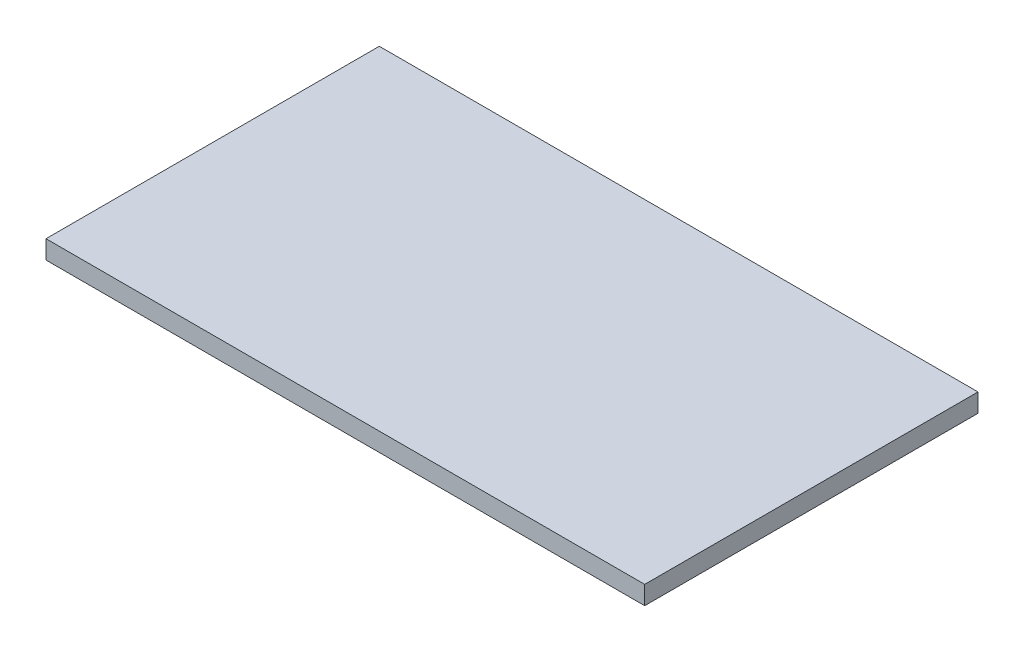
ISO-10303-21;
HEADER;
FILE_DESCRIPTION(('STEP AP214'),'2;1');
FILE_NAME('part.step','',(''),(''),'','','');
FILE_SCHEMA(('AUTOMOTIVE_DESIGN { 1 0 10303 214 1 1 1 1 }'));
ENDSEC;
DATA;
#1=APPLICATION_CONTEXT('core data for automotive mechanical design processes');
#2=APPLICATION_PROTOCOL_DEFINITION('international standard','automotive_design',2000,#1);
#3=PRODUCT_CONTEXT('',#1,'mechanical');
#4=PRODUCT('Part','Part','',(#3));
#5=PRODUCT_RELATED_PRODUCT_CATEGORY('part','',(#4));
#6=PRODUCT_DEFINITION_FORMATION('','',#4);
#7=PRODUCT_DEFINITION_CONTEXT('part definition',#1,'design');
#8=PRODUCT_DEFINITION('design','',#6,#7);
#9=PRODUCT_DEFINITION_SHAPE('','',#8);
#10=(LENGTH_UNIT() NAMED_UNIT(*) SI_UNIT(.MILLI.,.METRE.));
#11=(NAMED_UNIT(*) PLANE_ANGLE_UNIT() SI_UNIT($,.RADIAN.));
#12=(NAMED_UNIT(*) SI_UNIT($,.STERADIAN.) SOLID_ANGLE_UNIT());
#13=UNCERTAINTY_MEASURE_WITH_UNIT(LENGTH_MEASURE(1.E-05),#10,'distance_accuracy_value','');
#14=(GEOMETRIC_REPRESENTATION_CONTEXT(3) GLOBAL_UNCERTAINTY_ASSIGNED_CONTEXT((#13)) GLOBAL_UNIT_ASSIGNED_CONTEXT((#10,
#11,#12)) REPRESENTATION_CONTEXT('',''));
#15=CARTESIAN_POINT('',(0.,0.,0.));
#16=DIRECTION('',(0.,0.,1.));
#17=DIRECTION('',(1.,0.,0.));
#18=AXIS2_PLACEMENT_3D('',#15,#16,#17);
#19=CARTESIAN_POINT('',(0.,0.,2700.));
#20=DIRECTION('',(1.,0.,0.));
#21=DIRECTION('',(0.,0.,-1.));
#22=AXIS2_PLACEMENT_3D('',#19,#20,#21);
#23=PLANE('',#22);
#24=DIRECTION('',(0.,-1.,0.));
#25=VECTOR('',#24,1.);
#26=CARTESIAN_POINT('',(0.,0.,0.));
#27=LINE('',#26,#25);
#28=CARTESIAN_POINT('',(0.,150.,0.));
#29=VERTEX_POINT('',#28);
#30=CARTESIAN_POINT('',(0.,0.,0.));
#31=VERTEX_POINT('',#30);
#32=EDGE_CURVE('E99',#29,#31,#27,.T.);
#33=ORIENTED_EDGE('',*,*,#32,.T.);
#34=DIRECTION('',(0.,0.,-1.));
#35=VECTOR('',#34,1.);
#36=CARTESIAN_POINT('',(0.,0.,2700.));
#37=LINE('',#36,#35);
#38=CARTESIAN_POINT('',(0.,0.,2700.));
#39=VERTEX_POINT('',#38);
#40=EDGE_CURVE('E11',#39,#31,#37,.T.);
#41=ORIENTED_EDGE('',*,*,#40,.F.);
#42=DIRECTION('',(0.,-1.,0.));
#43=VECTOR('',#42,1.);
#44=CARTESIAN_POINT('',(0.,0.,2700.));
#45=LINE('',#44,#43);
#46=CARTESIAN_POINT('',(0.,150.,2700.));
#47=VERTEX_POINT('',#46);
#48=EDGE_CURVE('E87',#47,#39,#45,.T.);
#49=ORIENTED_EDGE('',*,*,#48,.F.);
#50=DIRECTION('',(0.,0.,-1.));
#51=VECTOR('',#50,1.);
#52=CARTESIAN_POINT('',(0.,150.,2700.));
#53=LINE('',#52,#51);
#54=EDGE_CURVE('E95',#47,#29,#53,.T.);
#55=ORIENTED_EDGE('',*,*,#54,.T.);
#56=EDGE_LOOP('',(#33,#41,#49,#55));
#57=FACE_BOUND('',#56,.T.);
#58=ADVANCED_FACE('F36',(#57),#23,.F.);
#59=CARTESIAN_POINT('',(0.,0.,2700.));
#60=DIRECTION('',(0.,1.,0.));
#61=DIRECTION('',(0.,0.,1.));
#62=AXIS2_PLACEMENT_3D('',#59,#60,#61);
#63=PLANE('',#62);
#64=DIRECTION('',(1.,0.,0.));
#65=VECTOR('',#64,1.);
#66=CARTESIAN_POINT('',(0.,0.,0.));
#67=LINE('',#66,#65);
#68=CARTESIAN_POINT('',(4850.,0.,0.));
#69=VERTEX_POINT('',#68);
#70=EDGE_CURVE('E91',#31,#69,#67,.T.);
#71=ORIENTED_EDGE('',*,*,#70,.T.);
#72=DIRECTION('',(0.,0.,-1.));
#73=VECTOR('',#72,1.);
#74=CARTESIAN_POINT('',(4850.,0.,2700.));
#75=LINE('',#74,#73);
#76=CARTESIAN_POINT('',(4850.,0.,2700.));
#77=VERTEX_POINT('',#76);
#78=EDGE_CURVE('E44',#77,#69,#75,.T.);
#79=ORIENTED_EDGE('',*,*,#78,.F.);
#80=DIRECTION('',(1.,0.,0.));
#81=VECTOR('',#80,1.);
#82=CARTESIAN_POINT('',(0.,0.,2700.));
#83=LINE('',#82,#81);
#84=EDGE_CURVE('E82',#39,#77,#83,.T.);
#85=ORIENTED_EDGE('',*,*,#84,.F.);
#86=ORIENTED_EDGE('',*,*,#40,.T.);
#87=EDGE_LOOP('',(#71,#79,#85,#86));
#88=FACE_BOUND('',#87,.T.);
#89=ADVANCED_FACE('F90',(#88),#63,.F.);
#90=CARTESIAN_POINT('',(4850.,0.,2700.));
#91=DIRECTION('',(-1.,0.,0.));
#92=DIRECTION('',(0.,0.,1.));
#93=AXIS2_PLACEMENT_3D('',#90,#91,#92);
#94=PLANE('',#93);
#95=DIRECTION('',(0.,1.,0.));
#96=VECTOR('',#95,1.);
#97=CARTESIAN_POINT('',(4850.,0.,0.));
#98=LINE('',#97,#96);
#99=CARTESIAN_POINT('',(4850.,150.,0.));
#100=VERTEX_POINT('',#99);
#101=EDGE_CURVE('E69',#69,#100,#98,.T.);
#102=ORIENTED_EDGE('',*,*,#101,.T.);
#103=DIRECTION('',(0.,0.,-1.));
#104=VECTOR('',#103,1.);
#105=CARTESIAN_POINT('',(4850.,150.,2700.));
#106=LINE('',#105,#104);
#107=CARTESIAN_POINT('',(4850.,150.,2700.));
#108=VERTEX_POINT('',#107);
#109=EDGE_CURVE('E92',#108,#100,#106,.T.);
#110=ORIENTED_EDGE('',*,*,#109,.F.);
#111=DIRECTION('',(0.,1.,0.));
#112=VECTOR('',#111,1.);
#113=CARTESIAN_POINT('',(4850.,0.,2700.));
#114=LINE('',#113,#112);
#115=EDGE_CURVE('E85',#77,#108,#114,.T.);
#116=ORIENTED_EDGE('',*,*,#115,.F.);
#117=ORIENTED_EDGE('',*,*,#78,.T.);
#118=EDGE_LOOP('',(#102,#110,#116,#117));
#119=FACE_BOUND('',#118,.T.);
#120=ADVANCED_FACE('F93',(#119),#94,.F.);
#121=CARTESIAN_POINT('',(0.,150.,2700.));
#122=DIRECTION('',(0.,-1.,0.));
#123=DIRECTION('',(1.,0.,0.));
#124=AXIS2_PLACEMENT_3D('',#121,#122,#123);
#125=PLANE('',#124);
#126=DIRECTION('',(-1.,0.,0.));
#127=VECTOR('',#126,1.);
#128=CARTESIAN_POINT('',(0.,150.,0.));
#129=LINE('',#128,#127);
#130=EDGE_CURVE('E75',#100,#29,#129,.T.);
#131=ORIENTED_EDGE('',*,*,#130,.T.);
#132=ORIENTED_EDGE('',*,*,#54,.F.);
#133=DIRECTION('',(-1.,0.,0.));
#134=VECTOR('',#133,1.);
#135=CARTESIAN_POINT('',(0.,150.,2700.));
#136=LINE('',#135,#134);
#137=EDGE_CURVE('E52',#108,#47,#136,.T.);
#138=ORIENTED_EDGE('',*,*,#137,.F.);
#139=ORIENTED_EDGE('',*,*,#109,.T.);
#140=EDGE_LOOP('',(#131,#132,#138,#139));
#141=FACE_BOUND('',#140,.T.);
#142=ADVANCED_FACE('F106',(#141),#125,.F.);
#143=CARTESIAN_POINT('',(0.,0.,2700.));
#144=DIRECTION('',(0.,0.,-1.));
#145=DIRECTION('',(-1.,0.,0.));
#146=AXIS2_PLACEMENT_3D('',#143,#144,#145);
#147=PLANE('',#146);
#148=ORIENTED_EDGE('',*,*,#48,.T.);
#149=ORIENTED_EDGE('',*,*,#84,.T.);
#150=ORIENTED_EDGE('',*,*,#115,.T.);
#151=ORIENTED_EDGE('',*,*,#137,.T.);
#152=EDGE_LOOP('',(#148,#149,#150,#151));
#153=FACE_BOUND('',#152,.T.);
#154=ADVANCED_FACE('F83',(#153),#147,.F.);
#155=CARTESIAN_POINT('',(0.,0.,0.));
#156=DIRECTION('',(0.,0.,-1.));
#157=DIRECTION('',(-1.,0.,0.));
#158=AXIS2_PLACEMENT_3D('',#155,#156,#157);
#159=PLANE('',#158);
#160=ORIENTED_EDGE('',*,*,#32,.F.);
#161=ORIENTED_EDGE('',*,*,#130,.F.);
#162=ORIENTED_EDGE('',*,*,#101,.F.);
#163=ORIENTED_EDGE('',*,*,#70,.F.);
#164=EDGE_LOOP('',(#160,#161,#162,#163));
#165=FACE_BOUND('',#164,.T.);
#166=ADVANCED_FACE('F109',(#165),#159,.T.);
#167=CLOSED_SHELL('',(#58,#89,#120,#142,#154,#166));
#168=MANIFOLD_SOLID_BREP('B2',#167);
#169=ADVANCED_BREP_SHAPE_REPRESENTATION('',(#18,#168),#14);
#170=SHAPE_DEFINITION_REPRESENTATION(#9,#169);
ENDSEC;
END-ISO-10303-21;
